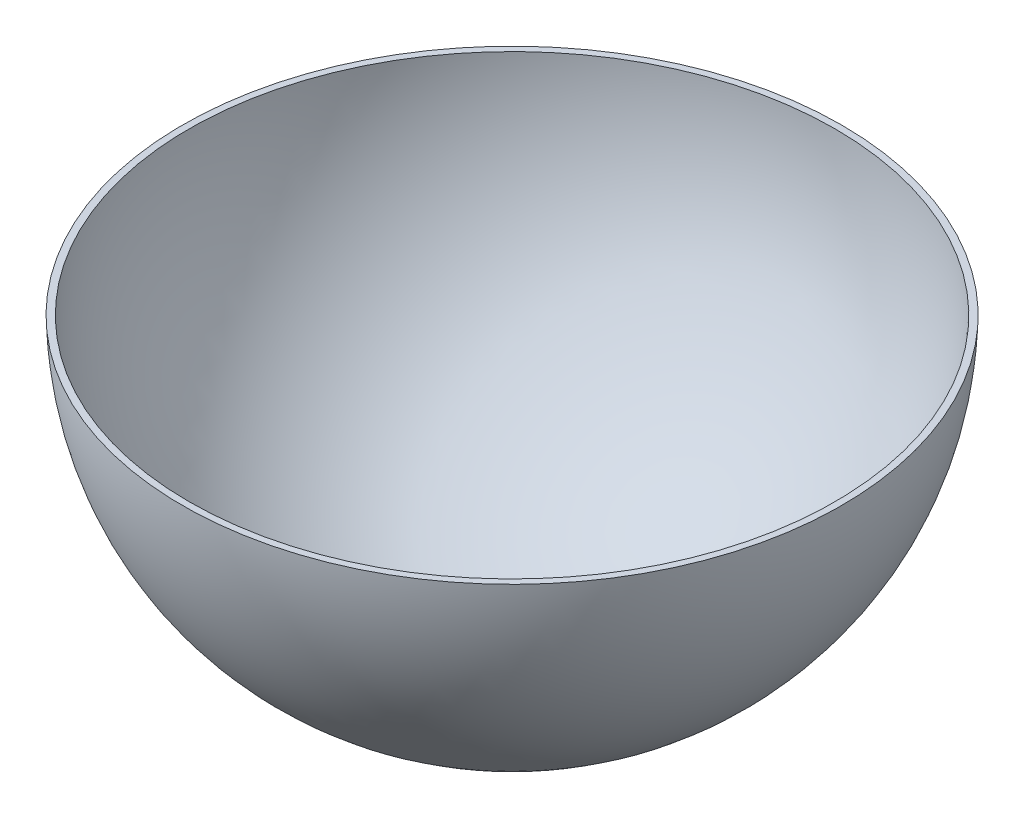
ISO-10303-21;
HEADER;
FILE_DESCRIPTION(('STEP AP214'),'2;1');
FILE_NAME('part.step','',(''),(''),'','','');
FILE_SCHEMA(('AUTOMOTIVE_DESIGN { 1 0 10303 214 1 1 1 1 }'));
ENDSEC;
DATA;
#1=APPLICATION_CONTEXT('core data for automotive mechanical design processes');
#2=APPLICATION_PROTOCOL_DEFINITION('international standard','automotive_design',2000,#1);
#3=PRODUCT_CONTEXT('',#1,'mechanical');
#4=PRODUCT('Part','Part','',(#3));
#5=PRODUCT_RELATED_PRODUCT_CATEGORY('part','',(#4));
#6=PRODUCT_DEFINITION_FORMATION('','',#4);
#7=PRODUCT_DEFINITION_CONTEXT('part definition',#1,'design');
#8=PRODUCT_DEFINITION('design','',#6,#7);
#9=PRODUCT_DEFINITION_SHAPE('','',#8);
#10=(LENGTH_UNIT() NAMED_UNIT(*) SI_UNIT(.MILLI.,.METRE.));
#11=(NAMED_UNIT(*) PLANE_ANGLE_UNIT() SI_UNIT($,.RADIAN.));
#12=(NAMED_UNIT(*) SI_UNIT($,.STERADIAN.) SOLID_ANGLE_UNIT());
#13=UNCERTAINTY_MEASURE_WITH_UNIT(LENGTH_MEASURE(1.E-05),#10,'distance_accuracy_value','');
#14=(GEOMETRIC_REPRESENTATION_CONTEXT(3) GLOBAL_UNCERTAINTY_ASSIGNED_CONTEXT((#13)) GLOBAL_UNIT_ASSIGNED_CONTEXT((#10,
#11,#12)) REPRESENTATION_CONTEXT('',''));
#15=CARTESIAN_POINT('',(0.,0.,0.));
#16=DIRECTION('',(0.,0.,1.));
#17=DIRECTION('',(1.,0.,0.));
#18=AXIS2_PLACEMENT_3D('',#15,#16,#17);
#19=CARTESIAN_POINT('',(0.,0.,0.));
#20=DIRECTION('',(0.,1.,0.));
#21=DIRECTION('',(0.,0.,-1.));
#22=AXIS2_PLACEMENT_3D('',#19,#20,#21);
#23=SPHERICAL_SURFACE('',#22,125.);
#24=CARTESIAN_POINT('',(0.,-3.19381449403772,0.));
#25=DIRECTION('',(0.,-1.,0.));
#26=DIRECTION('',(0.,0.,-1.));
#27=AXIS2_PLACEMENT_3D('',#24,#25,#26);
#28=CIRCLE('',#27,124.959191534587);
#29=CARTESIAN_POINT('',(0.,-3.19381449403772,-124.959191534587));
#30=VERTEX_POINT('',#29);
#31=EDGE_CURVE('E10',#30,#30,#28,.F.);
#32=ORIENTED_EDGE('',*,*,#31,.F.);
#33=EDGE_LOOP('',(#32));
#34=FACE_BOUND('',#33,.T.);
#35=ADVANCED_FACE('F32',(#34),#23,.T.);
#36=CARTESIAN_POINT('',(-160.62256044768,-3.19381449403772,-125.));
#37=DIRECTION('',(0.,-1.,0.));
#38=DIRECTION('',(0.,0.,-1.));
#39=AXIS2_PLACEMENT_3D('',#36,#37,#38);
#40=PLANE('',#39);
#41=ORIENTED_EDGE('',*,*,#31,.T.);
#42=EDGE_LOOP('',(#41));
#43=FACE_BOUND('',#42,.T.);
#44=CARTESIAN_POINT('',(0.,-3.19381449403772,0.));
#45=DIRECTION('',(0.,-1.,0.));
#46=DIRECTION('',(0.,0.,-1.));
#47=AXIS2_PLACEMENT_3D('',#44,#45,#46);
#48=CIRCLE('',#47,122.458358428397);
#49=CARTESIAN_POINT('',(0.,-3.19381449403772,-122.458358428397));
#50=VERTEX_POINT('',#49);
#51=EDGE_CURVE('E36',#50,#50,#48,.F.);
#52=ORIENTED_EDGE('',*,*,#51,.F.);
#53=EDGE_LOOP('',(#52));
#54=FACE_BOUND('',#53,.T.);
#55=ADVANCED_FACE('F46',(#43,#54),#40,.F.);
#56=CARTESIAN_POINT('',(0.,0.,0.));
#57=DIRECTION('',(0.,1.,0.));
#58=DIRECTION('',(0.,0.,-1.));
#59=AXIS2_PLACEMENT_3D('',#56,#57,#58);
#60=SPHERICAL_SURFACE('',#59,122.5);
#61=ORIENTED_EDGE('',*,*,#51,.T.);
#62=EDGE_LOOP('',(#61));
#63=FACE_BOUND('',#62,.T.);
#64=ADVANCED_FACE('F34',(#63),#60,.F.);
#65=CLOSED_SHELL('',(#35,#55,#64));
#66=MANIFOLD_SOLID_BREP('B2',#65);
#67=ADVANCED_BREP_SHAPE_REPRESENTATION('',(#18,#66),#14);
#68=SHAPE_DEFINITION_REPRESENTATION(#9,#67);
ENDSEC;
END-ISO-10303-21;
